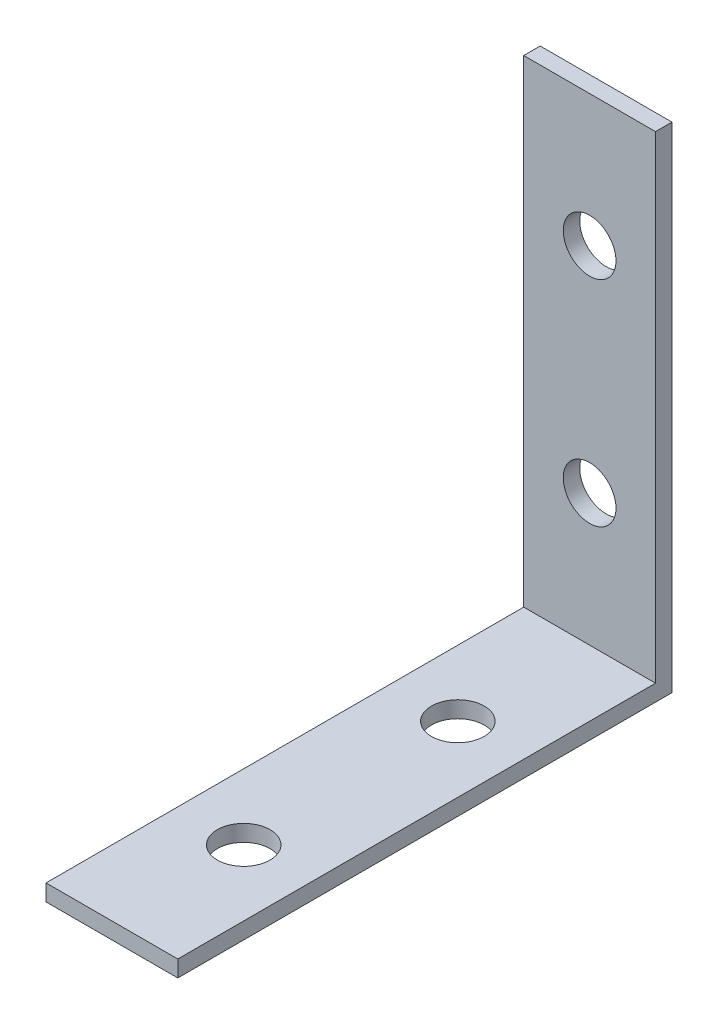
ISO-10303-21;
HEADER;
FILE_DESCRIPTION(('STEP AP214'),'2;1');
FILE_NAME('part.step','',(''),(''),'','','');
FILE_SCHEMA(('AUTOMOTIVE_DESIGN { 1 0 10303 214 1 1 1 1 }'));
ENDSEC;
DATA;
#1=APPLICATION_CONTEXT('core data for automotive mechanical design processes');
#2=APPLICATION_PROTOCOL_DEFINITION('international standard','automotive_design',2000,#1);
#3=PRODUCT_CONTEXT('',#1,'mechanical');
#4=PRODUCT('Part','Part','',(#3));
#5=PRODUCT_RELATED_PRODUCT_CATEGORY('part','',(#4));
#6=PRODUCT_DEFINITION_FORMATION('','',#4);
#7=PRODUCT_DEFINITION_CONTEXT('part definition',#1,'design');
#8=PRODUCT_DEFINITION('design','',#6,#7);
#9=PRODUCT_DEFINITION_SHAPE('','',#8);
#10=(LENGTH_UNIT() NAMED_UNIT(*) SI_UNIT(.MILLI.,.METRE.));
#11=(NAMED_UNIT(*) PLANE_ANGLE_UNIT() SI_UNIT($,.RADIAN.));
#12=(NAMED_UNIT(*) SI_UNIT($,.STERADIAN.) SOLID_ANGLE_UNIT());
#13=UNCERTAINTY_MEASURE_WITH_UNIT(LENGTH_MEASURE(1.E-05),#10,'distance_accuracy_value','');
#14=(GEOMETRIC_REPRESENTATION_CONTEXT(3) GLOBAL_UNCERTAINTY_ASSIGNED_CONTEXT((#13)) GLOBAL_UNIT_ASSIGNED_CONTEXT((#10,
#11,#12)) REPRESENTATION_CONTEXT('',''));
#15=CARTESIAN_POINT('',(0.,0.,0.));
#16=DIRECTION('',(0.,0.,1.));
#17=DIRECTION('',(1.,0.,0.));
#18=AXIS2_PLACEMENT_3D('',#15,#16,#17);
#19=CARTESIAN_POINT('',(9.99999999999999,2.5,-37.5));
#20=DIRECTION('',(-1.,0.,0.));
#21=DIRECTION('',(0.,0.,1.));
#22=AXIS2_PLACEMENT_3D('',#19,#20,#21);
#23=PLANE('',#22);
#24=DIRECTION('',(0.,0.,-1.));
#25=VECTOR('',#24,1.);
#26=CARTESIAN_POINT('',(9.99999999999999,0.,-37.5));
#27=LINE('',#26,#25);
#28=CARTESIAN_POINT('',(10.,0.,37.5));
#29=VERTEX_POINT('',#28);
#30=CARTESIAN_POINT('',(9.99999999999999,0.,-37.5));
#31=VERTEX_POINT('',#30);
#32=EDGE_CURVE('E91',#29,#31,#27,.T.);
#33=ORIENTED_EDGE('',*,*,#32,.T.);
#34=DIRECTION('',(0.,-1.,0.));
#35=VECTOR('',#34,1.);
#36=CARTESIAN_POINT('',(9.99999999999999,2.5,-37.5));
#37=LINE('',#36,#35);
#38=CARTESIAN_POINT('',(9.99999999999999,75.,-37.5));
#39=VERTEX_POINT('',#38);
#40=EDGE_CURVE('E11',#39,#31,#37,.T.);
#41=ORIENTED_EDGE('',*,*,#40,.F.);
#42=DIRECTION('',(0.,0.,-1.));
#43=VECTOR('',#42,1.);
#44=CARTESIAN_POINT('',(9.99999999999999,75.,-37.5));
#45=LINE('',#44,#43);
#46=CARTESIAN_POINT('',(10.,75.,-35.));
#47=VERTEX_POINT('',#46);
#48=EDGE_CURVE('E127',#47,#39,#45,.T.);
#49=ORIENTED_EDGE('',*,*,#48,.F.);
#50=DIRECTION('',(0.,-1.,0.));
#51=VECTOR('',#50,1.);
#52=CARTESIAN_POINT('',(10.,75.,-35.));
#53=LINE('',#52,#51);
#54=CARTESIAN_POINT('',(10.,2.5,-35.));
#55=VERTEX_POINT('',#54);
#56=EDGE_CURVE('E100',#47,#55,#53,.T.);
#57=ORIENTED_EDGE('',*,*,#56,.T.);
#58=DIRECTION('',(0.,0.,-1.));
#59=VECTOR('',#58,1.);
#60=CARTESIAN_POINT('',(9.99999999999999,2.5,-37.5));
#61=LINE('',#60,#59);
#62=CARTESIAN_POINT('',(10.,2.5,37.5));
#63=VERTEX_POINT('',#62);
#64=EDGE_CURVE('E85',#63,#55,#61,.T.);
#65=ORIENTED_EDGE('',*,*,#64,.F.);
#66=DIRECTION('',(0.,-1.,0.));
#67=VECTOR('',#66,1.);
#68=CARTESIAN_POINT('',(10.,2.5,37.5));
#69=LINE('',#68,#67);
#70=EDGE_CURVE('E78',#63,#29,#69,.T.);
#71=ORIENTED_EDGE('',*,*,#70,.T.);
#72=EDGE_LOOP('',(#33,#41,#49,#57,#65,#71));
#73=FACE_BOUND('',#72,.T.);
#74=ADVANCED_FACE('F36',(#73),#23,.F.);
#75=CARTESIAN_POINT('',(-10.,2.5,-37.5));
#76=DIRECTION('',(0.,0.,1.));
#77=DIRECTION('',(1.,0.,0.));
#78=AXIS2_PLACEMENT_3D('',#75,#76,#77);
#79=PLANE('',#78);
#80=CARTESIAN_POINT('',(0.,55.,-37.5));
#81=DIRECTION('',(0.,0.,1.));
#82=DIRECTION('',(1.,0.,0.));
#83=AXIS2_PLACEMENT_3D('',#80,#81,#82);
#84=CIRCLE('',#83,4.);
#85=CARTESIAN_POINT('',(4.,55.,-37.5));
#86=VERTEX_POINT('',#85);
#87=EDGE_CURVE('E151',#86,#86,#84,.T.);
#88=ORIENTED_EDGE('',*,*,#87,.T.);
#89=EDGE_LOOP('',(#88));
#90=FACE_BOUND('',#89,.T.);
#91=CARTESIAN_POINT('',(0.,22.5,-37.5));
#92=DIRECTION('',(0.,0.,1.));
#93=DIRECTION('',(1.,0.,0.));
#94=AXIS2_PLACEMENT_3D('',#91,#92,#93);
#95=CIRCLE('',#94,4.);
#96=CARTESIAN_POINT('',(4.,22.5,-37.5));
#97=VERTEX_POINT('',#96);
#98=EDGE_CURVE('E162',#97,#97,#95,.T.);
#99=ORIENTED_EDGE('',*,*,#98,.T.);
#100=EDGE_LOOP('',(#99));
#101=FACE_BOUND('',#100,.T.);
#102=DIRECTION('',(-1.,0.,0.));
#103=VECTOR('',#102,1.);
#104=CARTESIAN_POINT('',(-10.,0.,-37.5));
#105=LINE('',#104,#103);
#106=CARTESIAN_POINT('',(-10.,0.,-37.5));
#107=VERTEX_POINT('',#106);
#108=EDGE_CURVE('E95',#31,#107,#105,.T.);
#109=ORIENTED_EDGE('',*,*,#108,.T.);
#110=DIRECTION('',(0.,-1.,0.));
#111=VECTOR('',#110,1.);
#112=CARTESIAN_POINT('',(-10.,2.5,-37.5));
#113=LINE('',#112,#111);
#114=CARTESIAN_POINT('',(-10.,75.,-37.5));
#115=VERTEX_POINT('',#114);
#116=EDGE_CURVE('E43',#115,#107,#113,.T.);
#117=ORIENTED_EDGE('',*,*,#116,.F.);
#118=DIRECTION('',(-1.,0.,0.));
#119=VECTOR('',#118,1.);
#120=CARTESIAN_POINT('',(-10.,75.,-37.5));
#121=LINE('',#120,#119);
#122=EDGE_CURVE('E119',#39,#115,#121,.T.);
#123=ORIENTED_EDGE('',*,*,#122,.F.);
#124=ORIENTED_EDGE('',*,*,#40,.T.);
#125=EDGE_LOOP('',(#109,#117,#123,#124));
#126=FACE_BOUND('',#125,.T.);
#127=ADVANCED_FACE('F117',(#90,#101,#126),#79,.F.);
#128=CARTESIAN_POINT('',(-10.,2.5,-37.5));
#129=DIRECTION('',(1.,0.,0.));
#130=DIRECTION('',(0.,0.,-1.));
#131=AXIS2_PLACEMENT_3D('',#128,#129,#130);
#132=PLANE('',#131);
#133=DIRECTION('',(0.,0.,1.));
#134=VECTOR('',#133,1.);
#135=CARTESIAN_POINT('',(-10.,0.,-37.5));
#136=LINE('',#135,#134);
#137=CARTESIAN_POINT('',(-10.,0.,37.5));
#138=VERTEX_POINT('',#137);
#139=EDGE_CURVE('E86',#107,#138,#136,.T.);
#140=ORIENTED_EDGE('',*,*,#139,.T.);
#141=DIRECTION('',(0.,-1.,0.));
#142=VECTOR('',#141,1.);
#143=CARTESIAN_POINT('',(-10.,2.5,37.5));
#144=LINE('',#143,#142);
#145=CARTESIAN_POINT('',(-10.,2.5,37.5));
#146=VERTEX_POINT('',#145);
#147=EDGE_CURVE('E81',#146,#138,#144,.T.);
#148=ORIENTED_EDGE('',*,*,#147,.F.);
#149=DIRECTION('',(0.,0.,1.));
#150=VECTOR('',#149,1.);
#151=CARTESIAN_POINT('',(-10.,2.5,-37.5));
#152=LINE('',#151,#150);
#153=CARTESIAN_POINT('',(-10.,2.5,-35.));
#154=VERTEX_POINT('',#153);
#155=EDGE_CURVE('E136',#154,#146,#152,.T.);
#156=ORIENTED_EDGE('',*,*,#155,.F.);
#157=DIRECTION('',(0.,-1.,0.));
#158=VECTOR('',#157,1.);
#159=CARTESIAN_POINT('',(-10.,75.,-35.));
#160=LINE('',#159,#158);
#161=CARTESIAN_POINT('',(-10.,75.,-35.));
#162=VERTEX_POINT('',#161);
#163=EDGE_CURVE('E96',#162,#154,#160,.T.);
#164=ORIENTED_EDGE('',*,*,#163,.F.);
#165=DIRECTION('',(0.,0.,1.));
#166=VECTOR('',#165,1.);
#167=CARTESIAN_POINT('',(-10.,75.,-37.5));
#168=LINE('',#167,#166);
#169=EDGE_CURVE('E113',#115,#162,#168,.T.);
#170=ORIENTED_EDGE('',*,*,#169,.F.);
#171=ORIENTED_EDGE('',*,*,#116,.T.);
#172=EDGE_LOOP('',(#140,#148,#156,#164,#170,#171));
#173=FACE_BOUND('',#172,.T.);
#174=ADVANCED_FACE('F110',(#173),#132,.F.);
#175=CARTESIAN_POINT('',(-10.,2.5,37.5));
#176=DIRECTION('',(0.,0.,-1.));
#177=DIRECTION('',(-1.,0.,0.));
#178=AXIS2_PLACEMENT_3D('',#175,#176,#177);
#179=PLANE('',#178);
#180=DIRECTION('',(1.,0.,0.));
#181=VECTOR('',#180,1.);
#182=CARTESIAN_POINT('',(-10.,0.,37.5));
#183=LINE('',#182,#181);
#184=EDGE_CURVE('E75',#138,#29,#183,.T.);
#185=ORIENTED_EDGE('',*,*,#184,.T.);
#186=ORIENTED_EDGE('',*,*,#70,.F.);
#187=DIRECTION('',(1.,0.,0.));
#188=VECTOR('',#187,1.);
#189=CARTESIAN_POINT('',(-10.,2.5,37.5));
#190=LINE('',#189,#188);
#191=EDGE_CURVE('E56',#146,#63,#190,.T.);
#192=ORIENTED_EDGE('',*,*,#191,.F.);
#193=ORIENTED_EDGE('',*,*,#147,.T.);
#194=EDGE_LOOP('',(#185,#186,#192,#193));
#195=FACE_BOUND('',#194,.T.);
#196=ADVANCED_FACE('F77',(#195),#179,.F.);
#197=CARTESIAN_POINT('',(0.,2.5,0.));
#198=DIRECTION('',(0.,1.,0.));
#199=DIRECTION('',(0.,0.,1.));
#200=AXIS2_PLACEMENT_3D('',#197,#198,#199);
#201=PLANE('',#200);
#202=CARTESIAN_POINT('',(0.,2.5,-15.));
#203=DIRECTION('',(0.,1.,0.));
#204=DIRECTION('',(0.,0.,1.));
#205=AXIS2_PLACEMENT_3D('',#202,#203,#204);
#206=CIRCLE('',#205,4.);
#207=CARTESIAN_POINT('',(0.,2.5,-11.));
#208=VERTEX_POINT('',#207);
#209=EDGE_CURVE('E154',#208,#208,#206,.T.);
#210=ORIENTED_EDGE('',*,*,#209,.F.);
#211=EDGE_LOOP('',(#210));
#212=FACE_BOUND('',#211,.T.);
#213=CARTESIAN_POINT('',(0.,2.5,17.5));
#214=DIRECTION('',(0.,1.,0.));
#215=DIRECTION('',(0.,0.,1.));
#216=AXIS2_PLACEMENT_3D('',#213,#214,#215);
#217=CIRCLE('',#216,4.);
#218=CARTESIAN_POINT('',(0.,2.5,21.5));
#219=VERTEX_POINT('',#218);
#220=EDGE_CURVE('E147',#219,#219,#217,.T.);
#221=ORIENTED_EDGE('',*,*,#220,.F.);
#222=EDGE_LOOP('',(#221));
#223=FACE_BOUND('',#222,.T.);
#224=DIRECTION('',(1.,0.,0.));
#225=VECTOR('',#224,1.);
#226=CARTESIAN_POINT('',(-10.,2.5,-35.));
#227=LINE('',#226,#225);
#228=EDGE_CURVE('E50',#154,#55,#227,.T.);
#229=ORIENTED_EDGE('',*,*,#228,.F.);
#230=ORIENTED_EDGE('',*,*,#155,.T.);
#231=ORIENTED_EDGE('',*,*,#191,.T.);
#232=ORIENTED_EDGE('',*,*,#64,.T.);
#233=EDGE_LOOP('',(#229,#230,#231,#232));
#234=FACE_BOUND('',#233,.T.);
#235=ADVANCED_FACE('F137',(#212,#223,#234),#201,.T.);
#236=CARTESIAN_POINT('',(0.,0.,0.));
#237=DIRECTION('',(0.,1.,0.));
#238=DIRECTION('',(0.,0.,1.));
#239=AXIS2_PLACEMENT_3D('',#236,#237,#238);
#240=PLANE('',#239);
#241=CARTESIAN_POINT('',(0.,0.,-15.));
#242=DIRECTION('',(0.,1.,0.));
#243=DIRECTION('',(0.,0.,1.));
#244=AXIS2_PLACEMENT_3D('',#241,#242,#243);
#245=CIRCLE('',#244,4.);
#246=CARTESIAN_POINT('',(0.,0.,-11.));
#247=VERTEX_POINT('',#246);
#248=EDGE_CURVE('E134',#247,#247,#245,.T.);
#249=ORIENTED_EDGE('',*,*,#248,.T.);
#250=EDGE_LOOP('',(#249));
#251=FACE_BOUND('',#250,.T.);
#252=CARTESIAN_POINT('',(0.,0.,17.5));
#253=DIRECTION('',(0.,1.,0.));
#254=DIRECTION('',(0.,0.,1.));
#255=AXIS2_PLACEMENT_3D('',#252,#253,#254);
#256=CIRCLE('',#255,4.);
#257=CARTESIAN_POINT('',(0.,0.,21.5));
#258=VERTEX_POINT('',#257);
#259=EDGE_CURVE('E150',#258,#258,#256,.T.);
#260=ORIENTED_EDGE('',*,*,#259,.T.);
#261=EDGE_LOOP('',(#260));
#262=FACE_BOUND('',#261,.T.);
#263=ORIENTED_EDGE('',*,*,#32,.F.);
#264=ORIENTED_EDGE('',*,*,#184,.F.);
#265=ORIENTED_EDGE('',*,*,#139,.F.);
#266=ORIENTED_EDGE('',*,*,#108,.F.);
#267=EDGE_LOOP('',(#263,#264,#265,#266));
#268=FACE_BOUND('',#267,.T.);
#269=ADVANCED_FACE('F94',(#251,#262,#268),#240,.F.);
#270=CARTESIAN_POINT('',(-10.,75.,-35.));
#271=DIRECTION('',(0.,0.,-1.));
#272=DIRECTION('',(-1.,0.,0.));
#273=AXIS2_PLACEMENT_3D('',#270,#271,#272);
#274=PLANE('',#273);
#275=CARTESIAN_POINT('',(0.,55.,-35.));
#276=DIRECTION('',(0.,0.,1.));
#277=DIRECTION('',(1.,0.,0.));
#278=AXIS2_PLACEMENT_3D('',#275,#276,#277);
#279=CIRCLE('',#278,4.);
#280=CARTESIAN_POINT('',(4.,55.,-35.));
#281=VERTEX_POINT('',#280);
#282=EDGE_CURVE('E165',#281,#281,#279,.T.);
#283=ORIENTED_EDGE('',*,*,#282,.F.);
#284=EDGE_LOOP('',(#283));
#285=FACE_BOUND('',#284,.T.);
#286=CARTESIAN_POINT('',(0.,22.5,-35.));
#287=DIRECTION('',(0.,0.,1.));
#288=DIRECTION('',(1.,0.,0.));
#289=AXIS2_PLACEMENT_3D('',#286,#287,#288);
#290=CIRCLE('',#289,4.);
#291=CARTESIAN_POINT('',(4.,22.5,-35.));
#292=VERTEX_POINT('',#291);
#293=EDGE_CURVE('E159',#292,#292,#290,.T.);
#294=ORIENTED_EDGE('',*,*,#293,.F.);
#295=EDGE_LOOP('',(#294));
#296=FACE_BOUND('',#295,.T.);
#297=ORIENTED_EDGE('',*,*,#228,.T.);
#298=ORIENTED_EDGE('',*,*,#56,.F.);
#299=DIRECTION('',(1.,0.,0.));
#300=VECTOR('',#299,1.);
#301=CARTESIAN_POINT('',(-10.,75.,-35.));
#302=LINE('',#301,#300);
#303=EDGE_CURVE('E130',#162,#47,#302,.T.);
#304=ORIENTED_EDGE('',*,*,#303,.F.);
#305=ORIENTED_EDGE('',*,*,#163,.T.);
#306=EDGE_LOOP('',(#297,#298,#304,#305));
#307=FACE_BOUND('',#306,.T.);
#308=ADVANCED_FACE('F140',(#285,#296,#307),#274,.F.);
#309=CARTESIAN_POINT('',(0.,75.,0.));
#310=DIRECTION('',(0.,1.,0.));
#311=DIRECTION('',(0.,0.,1.));
#312=AXIS2_PLACEMENT_3D('',#309,#310,#311);
#313=PLANE('',#312);
#314=ORIENTED_EDGE('',*,*,#169,.T.);
#315=ORIENTED_EDGE('',*,*,#303,.T.);
#316=ORIENTED_EDGE('',*,*,#48,.T.);
#317=ORIENTED_EDGE('',*,*,#122,.T.);
#318=EDGE_LOOP('',(#314,#315,#316,#317));
#319=FACE_BOUND('',#318,.T.);
#320=ADVANCED_FACE('F123',(#319),#313,.T.);
#321=CARTESIAN_POINT('',(0.,0.,17.5));
#322=DIRECTION('',(0.,1.,0.));
#323=DIRECTION('',(0.,0.,1.));
#324=AXIS2_PLACEMENT_3D('',#321,#322,#323);
#325=CYLINDRICAL_SURFACE('',#324,4.);
#326=ORIENTED_EDGE('',*,*,#259,.F.);
#327=EDGE_LOOP('',(#326));
#328=FACE_BOUND('',#327,.T.);
#329=ORIENTED_EDGE('',*,*,#220,.T.);
#330=EDGE_LOOP('',(#329));
#331=FACE_BOUND('',#330,.T.);
#332=ADVANCED_FACE('F192',(#328,#331),#325,.F.);
#333=CARTESIAN_POINT('',(0.,0.,-15.));
#334=DIRECTION('',(0.,1.,0.));
#335=DIRECTION('',(0.,0.,1.));
#336=AXIS2_PLACEMENT_3D('',#333,#334,#335);
#337=CYLINDRICAL_SURFACE('',#336,4.);
#338=ORIENTED_EDGE('',*,*,#248,.F.);
#339=EDGE_LOOP('',(#338));
#340=FACE_BOUND('',#339,.T.);
#341=ORIENTED_EDGE('',*,*,#209,.T.);
#342=EDGE_LOOP('',(#341));
#343=FACE_BOUND('',#342,.T.);
#344=ADVANCED_FACE('F186',(#340,#343),#337,.F.);
#345=CARTESIAN_POINT('',(0.,22.5,-37.5));
#346=DIRECTION('',(0.,0.,1.));
#347=DIRECTION('',(1.,0.,0.));
#348=AXIS2_PLACEMENT_3D('',#345,#346,#347);
#349=CYLINDRICAL_SURFACE('',#348,4.);
#350=ORIENTED_EDGE('',*,*,#98,.F.);
#351=EDGE_LOOP('',(#350));
#352=FACE_BOUND('',#351,.T.);
#353=ORIENTED_EDGE('',*,*,#293,.T.);
#354=EDGE_LOOP('',(#353));
#355=FACE_BOUND('',#354,.T.);
#356=ADVANCED_FACE('F176',(#352,#355),#349,.F.);
#357=CARTESIAN_POINT('',(0.,55.,-37.5));
#358=DIRECTION('',(0.,0.,1.));
#359=DIRECTION('',(1.,0.,0.));
#360=AXIS2_PLACEMENT_3D('',#357,#358,#359);
#361=CYLINDRICAL_SURFACE('',#360,4.);
#362=ORIENTED_EDGE('',*,*,#87,.F.);
#363=EDGE_LOOP('',(#362));
#364=FACE_BOUND('',#363,.T.);
#365=ORIENTED_EDGE('',*,*,#282,.T.);
#366=EDGE_LOOP('',(#365));
#367=FACE_BOUND('',#366,.T.);
#368=ADVANCED_FACE('F173',(#364,#367),#361,.F.);
#369=CLOSED_SHELL('',(#74,#127,#174,#196,#235,#269,#308,#320,#332,#344,#356,#368));
#370=MANIFOLD_SOLID_BREP('B2',#369);
#371=ADVANCED_BREP_SHAPE_REPRESENTATION('',(#18,#370),#14);
#372=SHAPE_DEFINITION_REPRESENTATION(#9,#371);
ENDSEC;
END-ISO-10303-21;
